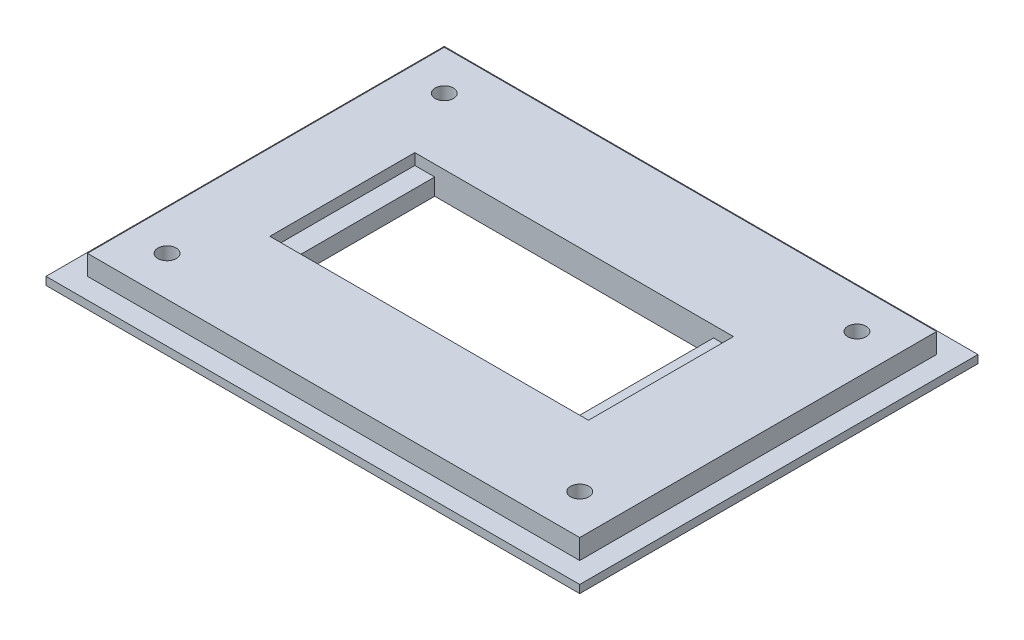
ISO-10303-21;
HEADER;
FILE_DESCRIPTION(('STEP AP214'),'2;1');
FILE_NAME('part.step','',(''),(''),'','','');
FILE_SCHEMA(('AUTOMOTIVE_DESIGN { 1 0 10303 214 1 1 1 1 }'));
ENDSEC;
DATA;
#1=APPLICATION_CONTEXT('core data for automotive mechanical design processes');
#2=APPLICATION_PROTOCOL_DEFINITION('international standard','automotive_design',2000,#1);
#3=PRODUCT_CONTEXT('',#1,'mechanical');
#4=PRODUCT('Part','Part','',(#3));
#5=PRODUCT_RELATED_PRODUCT_CATEGORY('part','',(#4));
#6=PRODUCT_DEFINITION_FORMATION('','',#4);
#7=PRODUCT_DEFINITION_CONTEXT('part definition',#1,'design');
#8=PRODUCT_DEFINITION('design','',#6,#7);
#9=PRODUCT_DEFINITION_SHAPE('','',#8);
#10=(LENGTH_UNIT() NAMED_UNIT(*) SI_UNIT(.MILLI.,.METRE.));
#11=(NAMED_UNIT(*) PLANE_ANGLE_UNIT() SI_UNIT($,.RADIAN.));
#12=(NAMED_UNIT(*) SI_UNIT($,.STERADIAN.) SOLID_ANGLE_UNIT());
#13=UNCERTAINTY_MEASURE_WITH_UNIT(LENGTH_MEASURE(1.E-05),#10,'distance_accuracy_value','');
#14=(GEOMETRIC_REPRESENTATION_CONTEXT(3) GLOBAL_UNCERTAINTY_ASSIGNED_CONTEXT((#13)) GLOBAL_UNIT_ASSIGNED_CONTEXT((#10,
#11,#12)) REPRESENTATION_CONTEXT('',''));
#15=CARTESIAN_POINT('',(0.,0.,0.));
#16=DIRECTION('',(0.,0.,1.));
#17=DIRECTION('',(1.,0.,0.));
#18=AXIS2_PLACEMENT_3D('',#15,#16,#17);
#19=CARTESIAN_POINT('',(0.,2.667,0.));
#20=DIRECTION('',(0.,1.,0.));
#21=DIRECTION('',(0.,0.,1.));
#22=AXIS2_PLACEMENT_3D('',#19,#20,#21);
#23=PLANE('',#22);
#24=DIRECTION('',(0.,0.,1.));
#25=VECTOR('',#24,1.);
#26=CARTESIAN_POINT('',(18.669,2.667,-43.307));
#27=LINE('',#26,#25);
#28=CARTESIAN_POINT('',(18.669,2.667,-43.307));
#29=VERTEX_POINT('',#28);
#30=CARTESIAN_POINT('',(18.669,2.667,-20.193));
#31=VERTEX_POINT('',#30);
#32=EDGE_CURVE('E154',#29,#31,#27,.T.);
#33=ORIENTED_EDGE('',*,*,#32,.F.);
#34=DIRECTION('',(-1.,0.,0.));
#35=VECTOR('',#34,1.);
#36=CARTESIAN_POINT('',(15.494,2.667,-43.307));
#37=LINE('',#36,#35);
#38=CARTESIAN_POINT('',(15.494,2.667,-43.307));
#39=VERTEX_POINT('',#38);
#40=EDGE_CURVE('E197',#29,#39,#37,.T.);
#41=ORIENTED_EDGE('',*,*,#40,.T.);
#42=DIRECTION('',(0.,0.,1.));
#43=VECTOR('',#42,1.);
#44=CARTESIAN_POINT('',(15.494,2.667,-43.307));
#45=LINE('',#44,#43);
#46=CARTESIAN_POINT('',(15.494,2.667,-20.193));
#47=VERTEX_POINT('',#46);
#48=EDGE_CURVE('E187',#39,#47,#45,.T.);
#49=ORIENTED_EDGE('',*,*,#48,.T.);
#50=DIRECTION('',(1.,0.,0.));
#51=VECTOR('',#50,1.);
#52=CARTESIAN_POINT('',(15.494,2.667,-20.193));
#53=LINE('',#52,#51);
#54=EDGE_CURVE('E192',#47,#31,#53,.T.);
#55=ORIENTED_EDGE('',*,*,#54,.T.);
#56=EDGE_LOOP('',(#33,#41,#49,#55));
#57=FACE_BOUND('',#56,.T.);
#58=ADVANCED_FACE('F35',(#57),#23,.T.);
#59=CARTESIAN_POINT('',(0.,1.27,0.));
#60=DIRECTION('',(0.,-1.,0.));
#61=DIRECTION('',(0.,0.,-1.));
#62=AXIS2_PLACEMENT_3D('',#59,#60,#61);
#63=PLANE('',#62);
#64=DIRECTION('',(0.,0.,1.));
#65=VECTOR('',#64,1.);
#66=CARTESIAN_POINT('',(0.,1.27,0.));
#67=LINE('',#66,#65);
#68=CARTESIAN_POINT('',(0.,1.27,-63.5));
#69=VERTEX_POINT('',#68);
#70=CARTESIAN_POINT('',(0.,1.27,0.));
#71=VERTEX_POINT('',#70);
#72=EDGE_CURVE('E252',#69,#71,#67,.T.);
#73=ORIENTED_EDGE('',*,*,#72,.T.);
#74=DIRECTION('',(1.,0.,0.));
#75=VECTOR('',#74,1.);
#76=CARTESIAN_POINT('',(0.,1.27,0.));
#77=LINE('',#76,#75);
#78=CARTESIAN_POINT('',(85.09,1.27,0.));
#79=VERTEX_POINT('',#78);
#80=EDGE_CURVE('E255',#71,#79,#77,.T.);
#81=ORIENTED_EDGE('',*,*,#80,.T.);
#82=DIRECTION('',(0.,0.,-1.));
#83=VECTOR('',#82,1.);
#84=CARTESIAN_POINT('',(85.09,1.27,0.));
#85=LINE('',#84,#83);
#86=CARTESIAN_POINT('',(85.09,1.27,-63.5));
#87=VERTEX_POINT('',#86);
#88=EDGE_CURVE('E258',#79,#87,#85,.T.);
#89=ORIENTED_EDGE('',*,*,#88,.T.);
#90=DIRECTION('',(-1.,0.,0.));
#91=VECTOR('',#90,1.);
#92=CARTESIAN_POINT('',(0.,1.27,-63.5));
#93=LINE('',#92,#91);
#94=EDGE_CURVE('E260',#87,#69,#93,.T.);
#95=ORIENTED_EDGE('',*,*,#94,.T.);
#96=EDGE_LOOP('',(#73,#81,#89,#95));
#97=FACE_BOUND('',#96,.T.);
#98=DIRECTION('',(0.,0.,1.));
#99=VECTOR('',#98,1.);
#100=CARTESIAN_POINT('',(3.302,1.27,-60.198));
#101=LINE('',#100,#99);
#102=CARTESIAN_POINT('',(3.302,1.27,-60.198));
#103=VERTEX_POINT('',#102);
#104=CARTESIAN_POINT('',(3.30200000000001,1.27,-3.302));
#105=VERTEX_POINT('',#104);
#106=EDGE_CURVE('E212',#103,#105,#101,.T.);
#107=ORIENTED_EDGE('',*,*,#106,.F.);
#108=DIRECTION('',(-1.,0.,0.));
#109=VECTOR('',#108,1.);
#110=CARTESIAN_POINT('',(3.302,1.27,-60.198));
#111=LINE('',#110,#109);
#112=CARTESIAN_POINT('',(81.788,1.27,-60.198));
#113=VERTEX_POINT('',#112);
#114=EDGE_CURVE('E223',#113,#103,#111,.T.);
#115=ORIENTED_EDGE('',*,*,#114,.F.);
#116=DIRECTION('',(0.,0.,-1.));
#117=VECTOR('',#116,1.);
#118=CARTESIAN_POINT('',(81.788,1.27,-60.198));
#119=LINE('',#118,#117);
#120=CARTESIAN_POINT('',(81.788,1.27,-3.302));
#121=VERTEX_POINT('',#120);
#122=EDGE_CURVE('E235',#121,#113,#119,.T.);
#123=ORIENTED_EDGE('',*,*,#122,.F.);
#124=DIRECTION('',(1.,0.,0.));
#125=VECTOR('',#124,1.);
#126=CARTESIAN_POINT('',(3.30200000000001,1.27,-3.302));
#127=LINE('',#126,#125);
#128=EDGE_CURVE('E232',#105,#121,#127,.T.);
#129=ORIENTED_EDGE('',*,*,#128,.F.);
#130=EDGE_LOOP('',(#107,#115,#123,#129));
#131=FACE_BOUND('',#130,.T.);
#132=ADVANCED_FACE('F292',(#97,#131),#63,.F.);
#133=CARTESIAN_POINT('',(0.,1.27,0.));
#134=DIRECTION('',(1.,0.,0.));
#135=DIRECTION('',(0.,0.,-1.));
#136=AXIS2_PLACEMENT_3D('',#133,#134,#135);
#137=PLANE('',#136);
#138=DIRECTION('',(0.,0.,1.));
#139=VECTOR('',#138,1.);
#140=CARTESIAN_POINT('',(0.,0.,0.));
#141=LINE('',#140,#139);
#142=CARTESIAN_POINT('',(0.,0.,-63.5));
#143=VERTEX_POINT('',#142);
#144=CARTESIAN_POINT('',(0.,0.,0.));
#145=VERTEX_POINT('',#144);
#146=EDGE_CURVE('E251',#143,#145,#141,.T.);
#147=ORIENTED_EDGE('',*,*,#146,.T.);
#148=DIRECTION('',(0.,-1.,0.));
#149=VECTOR('',#148,1.);
#150=CARTESIAN_POINT('',(0.,1.27,0.));
#151=LINE('',#150,#149);
#152=EDGE_CURVE('E11',#71,#145,#151,.T.);
#153=ORIENTED_EDGE('',*,*,#152,.F.);
#154=ORIENTED_EDGE('',*,*,#72,.F.);
#155=DIRECTION('',(0.,-1.,0.));
#156=VECTOR('',#155,1.);
#157=CARTESIAN_POINT('',(0.,1.27,-63.5));
#158=LINE('',#157,#156);
#159=EDGE_CURVE('E262',#69,#143,#158,.T.);
#160=ORIENTED_EDGE('',*,*,#159,.T.);
#161=EDGE_LOOP('',(#147,#153,#154,#160));
#162=FACE_BOUND('',#161,.T.);
#163=ADVANCED_FACE('F37',(#162),#137,.F.);
#164=CARTESIAN_POINT('',(0.,1.27,0.));
#165=DIRECTION('',(0.,0.,-1.));
#166=DIRECTION('',(-1.,0.,0.));
#167=AXIS2_PLACEMENT_3D('',#164,#165,#166);
#168=PLANE('',#167);
#169=DIRECTION('',(1.,0.,0.));
#170=VECTOR('',#169,1.);
#171=CARTESIAN_POINT('',(0.,0.,0.));
#172=LINE('',#171,#170);
#173=CARTESIAN_POINT('',(85.09,0.,0.));
#174=VERTEX_POINT('',#173);
#175=EDGE_CURVE('E265',#145,#174,#172,.T.);
#176=ORIENTED_EDGE('',*,*,#175,.T.);
#177=DIRECTION('',(0.,-1.,0.));
#178=VECTOR('',#177,1.);
#179=CARTESIAN_POINT('',(85.09,1.27,0.));
#180=LINE('',#179,#178);
#181=EDGE_CURVE('E43',#79,#174,#180,.T.);
#182=ORIENTED_EDGE('',*,*,#181,.F.);
#183=ORIENTED_EDGE('',*,*,#80,.F.);
#184=ORIENTED_EDGE('',*,*,#152,.T.);
#185=EDGE_LOOP('',(#176,#182,#183,#184));
#186=FACE_BOUND('',#185,.T.);
#187=ADVANCED_FACE('F294',(#186),#168,.F.);
#188=CARTESIAN_POINT('',(85.09,1.27,0.));
#189=DIRECTION('',(-1.,0.,0.));
#190=DIRECTION('',(0.,0.,1.));
#191=AXIS2_PLACEMENT_3D('',#188,#189,#190);
#192=PLANE('',#191);
#193=DIRECTION('',(0.,0.,-1.));
#194=VECTOR('',#193,1.);
#195=CARTESIAN_POINT('',(85.09,0.,0.));
#196=LINE('',#195,#194);
#197=CARTESIAN_POINT('',(85.09,0.,-63.5));
#198=VERTEX_POINT('',#197);
#199=EDGE_CURVE('E267',#174,#198,#196,.T.);
#200=ORIENTED_EDGE('',*,*,#199,.T.);
#201=DIRECTION('',(0.,-1.,0.));
#202=VECTOR('',#201,1.);
#203=CARTESIAN_POINT('',(85.09,1.27,-63.5));
#204=LINE('',#203,#202);
#205=EDGE_CURVE('E272',#87,#198,#204,.T.);
#206=ORIENTED_EDGE('',*,*,#205,.F.);
#207=ORIENTED_EDGE('',*,*,#88,.F.);
#208=ORIENTED_EDGE('',*,*,#181,.T.);
#209=EDGE_LOOP('',(#200,#206,#207,#208));
#210=FACE_BOUND('',#209,.T.);
#211=ADVANCED_FACE('F279',(#210),#192,.F.);
#212=CARTESIAN_POINT('',(0.,1.27,-63.5));
#213=DIRECTION('',(0.,0.,1.));
#214=DIRECTION('',(1.,0.,0.));
#215=AXIS2_PLACEMENT_3D('',#212,#213,#214);
#216=PLANE('',#215);
#217=DIRECTION('',(-1.,0.,0.));
#218=VECTOR('',#217,1.);
#219=CARTESIAN_POINT('',(0.,0.,-63.5));
#220=LINE('',#219,#218);
#221=EDGE_CURVE('E256',#198,#143,#220,.T.);
#222=ORIENTED_EDGE('',*,*,#221,.T.);
#223=ORIENTED_EDGE('',*,*,#159,.F.);
#224=ORIENTED_EDGE('',*,*,#94,.F.);
#225=ORIENTED_EDGE('',*,*,#205,.T.);
#226=EDGE_LOOP('',(#222,#223,#224,#225));
#227=FACE_BOUND('',#226,.T.);
#228=ADVANCED_FACE('F286',(#227),#216,.F.);
#229=CARTESIAN_POINT('',(0.,0.,0.));
#230=DIRECTION('',(0.,-1.,0.));
#231=DIRECTION('',(0.,0.,-1.));
#232=AXIS2_PLACEMENT_3D('',#229,#230,#231);
#233=PLANE('',#232);
#234=CARTESIAN_POINT('',(9.652,0.,-9.652));
#235=DIRECTION('',(0.,1.,0.));
#236=DIRECTION('',(0.,0.,1.));
#237=AXIS2_PLACEMENT_3D('',#234,#235,#236);
#238=CIRCLE('',#237,1.4605);
#239=CARTESIAN_POINT('',(9.652,0.,-8.1915));
#240=VERTEX_POINT('',#239);
#241=EDGE_CURVE('E362',#240,#240,#238,.T.);
#242=ORIENTED_EDGE('',*,*,#241,.T.);
#243=EDGE_LOOP('',(#242));
#244=FACE_BOUND('',#243,.T.);
#245=CARTESIAN_POINT('',(75.438,0.,-53.848));
#246=DIRECTION('',(0.,1.,0.));
#247=DIRECTION('',(0.,0.,1.));
#248=AXIS2_PLACEMENT_3D('',#245,#246,#247);
#249=CIRCLE('',#248,1.4605);
#250=CARTESIAN_POINT('',(75.438,0.,-52.3875));
#251=VERTEX_POINT('',#250);
#252=EDGE_CURVE('E368',#251,#251,#249,.T.);
#253=ORIENTED_EDGE('',*,*,#252,.T.);
#254=EDGE_LOOP('',(#253));
#255=FACE_BOUND('',#254,.T.);
#256=CARTESIAN_POINT('',(75.438,0.,-9.652));
#257=DIRECTION('',(0.,1.,0.));
#258=DIRECTION('',(0.,0.,1.));
#259=AXIS2_PLACEMENT_3D('',#256,#257,#258);
#260=CIRCLE('',#259,1.4605);
#261=CARTESIAN_POINT('',(75.438,0.,-8.1915));
#262=VERTEX_POINT('',#261);
#263=EDGE_CURVE('E353',#262,#262,#260,.T.);
#264=ORIENTED_EDGE('',*,*,#263,.T.);
#265=EDGE_LOOP('',(#264));
#266=FACE_BOUND('',#265,.T.);
#267=CARTESIAN_POINT('',(9.652,0.,-53.848));
#268=DIRECTION('',(0.,1.,0.));
#269=DIRECTION('',(0.,0.,1.));
#270=AXIS2_PLACEMENT_3D('',#267,#268,#269);
#271=CIRCLE('',#270,1.4605);
#272=CARTESIAN_POINT('',(9.652,0.,-52.3875));
#273=VERTEX_POINT('',#272);
#274=EDGE_CURVE('E179',#273,#273,#271,.T.);
#275=ORIENTED_EDGE('',*,*,#274,.T.);
#276=EDGE_LOOP('',(#275));
#277=FACE_BOUND('',#276,.T.);
#278=DIRECTION('',(0.,0.,1.));
#279=VECTOR('',#278,1.);
#280=CARTESIAN_POINT('',(18.669,0.,-43.307));
#281=LINE('',#280,#279);
#282=CARTESIAN_POINT('',(18.669,0.,-43.307));
#283=VERTEX_POINT('',#282);
#284=CARTESIAN_POINT('',(18.669,0.,-20.193));
#285=VERTEX_POINT('',#284);
#286=EDGE_CURVE('E151',#283,#285,#281,.T.);
#287=ORIENTED_EDGE('',*,*,#286,.T.);
#288=DIRECTION('',(1.,0.,0.));
#289=VECTOR('',#288,1.);
#290=CARTESIAN_POINT('',(18.669,0.,-20.193));
#291=LINE('',#290,#289);
#292=CARTESIAN_POINT('',(63.119,0.,-20.193));
#293=VERTEX_POINT('',#292);
#294=EDGE_CURVE('E161',#285,#293,#291,.T.);
#295=ORIENTED_EDGE('',*,*,#294,.T.);
#296=DIRECTION('',(0.,0.,-1.));
#297=VECTOR('',#296,1.);
#298=CARTESIAN_POINT('',(63.119,0.,-43.307));
#299=LINE('',#298,#297);
#300=CARTESIAN_POINT('',(63.119,0.,-43.307));
#301=VERTEX_POINT('',#300);
#302=EDGE_CURVE('E55',#293,#301,#299,.T.);
#303=ORIENTED_EDGE('',*,*,#302,.T.);
#304=DIRECTION('',(-1.,0.,0.));
#305=VECTOR('',#304,1.);
#306=CARTESIAN_POINT('',(18.669,0.,-43.307));
#307=LINE('',#306,#305);
#308=EDGE_CURVE('E158',#301,#283,#307,.T.);
#309=ORIENTED_EDGE('',*,*,#308,.T.);
#310=EDGE_LOOP('',(#287,#295,#303,#309));
#311=FACE_BOUND('',#310,.T.);
#312=ORIENTED_EDGE('',*,*,#146,.F.);
#313=ORIENTED_EDGE('',*,*,#221,.F.);
#314=ORIENTED_EDGE('',*,*,#199,.F.);
#315=ORIENTED_EDGE('',*,*,#175,.F.);
#316=EDGE_LOOP('',(#312,#313,#314,#315));
#317=FACE_BOUND('',#316,.T.);
#318=ADVANCED_FACE('F167',(#244,#255,#266,#277,#311,#317),#233,.T.);
#319=CARTESIAN_POINT('',(3.302,4.445,-60.198));
#320=DIRECTION('',(1.,0.,0.));
#321=DIRECTION('',(0.,0.,-1.));
#322=AXIS2_PLACEMENT_3D('',#319,#320,#321);
#323=PLANE('',#322);
#324=ORIENTED_EDGE('',*,*,#106,.T.);
#325=DIRECTION('',(0.,-1.,0.));
#326=VECTOR('',#325,1.);
#327=CARTESIAN_POINT('',(3.30200000000001,4.445,-3.302));
#328=LINE('',#327,#326);
#329=CARTESIAN_POINT('',(3.30200000000001,4.445,-3.302));
#330=VERTEX_POINT('',#329);
#331=EDGE_CURVE('E248',#330,#105,#328,.T.);
#332=ORIENTED_EDGE('',*,*,#331,.F.);
#333=DIRECTION('',(0.,0.,1.));
#334=VECTOR('',#333,1.);
#335=CARTESIAN_POINT('',(3.302,4.445,-60.198));
#336=LINE('',#335,#334);
#337=CARTESIAN_POINT('',(3.302,4.445,-60.198));
#338=VERTEX_POINT('',#337);
#339=EDGE_CURVE('E219',#338,#330,#336,.T.);
#340=ORIENTED_EDGE('',*,*,#339,.F.);
#341=DIRECTION('',(0.,-1.,0.));
#342=VECTOR('',#341,1.);
#343=CARTESIAN_POINT('',(3.302,4.445,-60.198));
#344=LINE('',#343,#342);
#345=EDGE_CURVE('E229',#338,#103,#344,.T.);
#346=ORIENTED_EDGE('',*,*,#345,.T.);
#347=EDGE_LOOP('',(#324,#332,#340,#346));
#348=FACE_BOUND('',#347,.T.);
#349=ADVANCED_FACE('F395',(#348),#323,.F.);
#350=CARTESIAN_POINT('',(3.30200000000001,4.445,-3.302));
#351=DIRECTION('',(0.,0.,-1.));
#352=DIRECTION('',(-1.,0.,0.));
#353=AXIS2_PLACEMENT_3D('',#350,#351,#352);
#354=PLANE('',#353);
#355=ORIENTED_EDGE('',*,*,#128,.T.);
#356=DIRECTION('',(0.,-1.,0.));
#357=VECTOR('',#356,1.);
#358=CARTESIAN_POINT('',(81.788,4.445,-3.302));
#359=LINE('',#358,#357);
#360=CARTESIAN_POINT('',(81.788,4.445,-3.302));
#361=VERTEX_POINT('',#360);
#362=EDGE_CURVE('E245',#361,#121,#359,.T.);
#363=ORIENTED_EDGE('',*,*,#362,.F.);
#364=DIRECTION('',(1.,0.,0.));
#365=VECTOR('',#364,1.);
#366=CARTESIAN_POINT('',(3.30200000000001,4.445,-3.302));
#367=LINE('',#366,#365);
#368=EDGE_CURVE('E222',#330,#361,#367,.T.);
#369=ORIENTED_EDGE('',*,*,#368,.F.);
#370=ORIENTED_EDGE('',*,*,#331,.T.);
#371=EDGE_LOOP('',(#355,#363,#369,#370));
#372=FACE_BOUND('',#371,.T.);
#373=ADVANCED_FACE('F397',(#372),#354,.F.);
#374=CARTESIAN_POINT('',(81.788,4.445,-60.198));
#375=DIRECTION('',(-1.,0.,0.));
#376=DIRECTION('',(0.,0.,1.));
#377=AXIS2_PLACEMENT_3D('',#374,#375,#376);
#378=PLANE('',#377);
#379=ORIENTED_EDGE('',*,*,#122,.T.);
#380=DIRECTION('',(0.,-1.,0.));
#381=VECTOR('',#380,1.);
#382=CARTESIAN_POINT('',(81.788,4.445,-60.198));
#383=LINE('',#382,#381);
#384=CARTESIAN_POINT('',(81.788,4.445,-60.198));
#385=VERTEX_POINT('',#384);
#386=EDGE_CURVE('E242',#385,#113,#383,.T.);
#387=ORIENTED_EDGE('',*,*,#386,.F.);
#388=DIRECTION('',(0.,0.,-1.));
#389=VECTOR('',#388,1.);
#390=CARTESIAN_POINT('',(81.788,4.445,-60.198));
#391=LINE('',#390,#389);
#392=EDGE_CURVE('E225',#361,#385,#391,.T.);
#393=ORIENTED_EDGE('',*,*,#392,.F.);
#394=ORIENTED_EDGE('',*,*,#362,.T.);
#395=EDGE_LOOP('',(#379,#387,#393,#394));
#396=FACE_BOUND('',#395,.T.);
#397=ADVANCED_FACE('F401',(#396),#378,.F.);
#398=CARTESIAN_POINT('',(3.302,4.445,-60.198));
#399=DIRECTION('',(0.,0.,1.));
#400=DIRECTION('',(1.,0.,0.));
#401=AXIS2_PLACEMENT_3D('',#398,#399,#400);
#402=PLANE('',#401);
#403=ORIENTED_EDGE('',*,*,#114,.T.);
#404=ORIENTED_EDGE('',*,*,#345,.F.);
#405=DIRECTION('',(-1.,0.,0.));
#406=VECTOR('',#405,1.);
#407=CARTESIAN_POINT('',(3.302,4.445,-60.198));
#408=LINE('',#407,#406);
#409=EDGE_CURVE('E227',#385,#338,#408,.T.);
#410=ORIENTED_EDGE('',*,*,#409,.F.);
#411=ORIENTED_EDGE('',*,*,#386,.T.);
#412=EDGE_LOOP('',(#403,#404,#410,#411));
#413=FACE_BOUND('',#412,.T.);
#414=ADVANCED_FACE('F383',(#413),#402,.F.);
#415=CARTESIAN_POINT('',(0.,4.445,0.));
#416=DIRECTION('',(0.,1.,0.));
#417=DIRECTION('',(0.,0.,1.));
#418=AXIS2_PLACEMENT_3D('',#415,#416,#417);
#419=PLANE('',#418);
#420=CARTESIAN_POINT('',(9.652,4.445,-9.652));
#421=DIRECTION('',(0.,1.,0.));
#422=DIRECTION('',(0.,0.,1.));
#423=AXIS2_PLACEMENT_3D('',#420,#421,#422);
#424=CIRCLE('',#423,1.4605);
#425=CARTESIAN_POINT('',(9.652,4.445,-8.1915));
#426=VERTEX_POINT('',#425);
#427=EDGE_CURVE('E365',#426,#426,#424,.T.);
#428=ORIENTED_EDGE('',*,*,#427,.F.);
#429=EDGE_LOOP('',(#428));
#430=FACE_BOUND('',#429,.T.);
#431=CARTESIAN_POINT('',(75.438,4.445,-53.848));
#432=DIRECTION('',(0.,1.,0.));
#433=DIRECTION('',(0.,0.,1.));
#434=AXIS2_PLACEMENT_3D('',#431,#432,#433);
#435=CIRCLE('',#434,1.4605);
#436=CARTESIAN_POINT('',(75.438,4.445,-52.3875));
#437=VERTEX_POINT('',#436);
#438=EDGE_CURVE('E359',#437,#437,#435,.T.);
#439=ORIENTED_EDGE('',*,*,#438,.F.);
#440=EDGE_LOOP('',(#439));
#441=FACE_BOUND('',#440,.T.);
#442=CARTESIAN_POINT('',(75.438,4.445,-9.652));
#443=DIRECTION('',(0.,1.,0.));
#444=DIRECTION('',(0.,0.,1.));
#445=AXIS2_PLACEMENT_3D('',#442,#443,#444);
#446=CIRCLE('',#445,1.4605);
#447=CARTESIAN_POINT('',(75.438,4.445,-8.1915));
#448=VERTEX_POINT('',#447);
#449=EDGE_CURVE('E356',#448,#448,#446,.T.);
#450=ORIENTED_EDGE('',*,*,#449,.F.);
#451=EDGE_LOOP('',(#450));
#452=FACE_BOUND('',#451,.T.);
#453=CARTESIAN_POINT('',(9.652,4.445,-53.848));
#454=DIRECTION('',(0.,1.,0.));
#455=DIRECTION('',(0.,0.,1.));
#456=AXIS2_PLACEMENT_3D('',#453,#454,#455);
#457=CIRCLE('',#456,1.4605);
#458=CARTESIAN_POINT('',(9.652,4.445,-52.3875));
#459=VERTEX_POINT('',#458);
#460=EDGE_CURVE('E174',#459,#459,#457,.T.);
#461=ORIENTED_EDGE('',*,*,#460,.F.);
#462=EDGE_LOOP('',(#461));
#463=FACE_BOUND('',#462,.T.);
#464=DIRECTION('',(0.,0.,1.));
#465=VECTOR('',#464,1.);
#466=CARTESIAN_POINT('',(15.494,4.445,-43.307));
#467=LINE('',#466,#465);
#468=CARTESIAN_POINT('',(15.494,4.445,-43.307));
#469=VERTEX_POINT('',#468);
#470=CARTESIAN_POINT('',(15.494,4.445,-20.193));
#471=VERTEX_POINT('',#470);
#472=EDGE_CURVE('E183',#469,#471,#467,.T.);
#473=ORIENTED_EDGE('',*,*,#472,.F.);
#474=DIRECTION('',(-1.,0.,0.));
#475=VECTOR('',#474,1.);
#476=CARTESIAN_POINT('',(15.494,4.445,-43.307));
#477=LINE('',#476,#475);
#478=CARTESIAN_POINT('',(66.294,4.445,-43.307));
#479=VERTEX_POINT('',#478);
#480=EDGE_CURVE('E191',#479,#469,#477,.T.);
#481=ORIENTED_EDGE('',*,*,#480,.F.);
#482=DIRECTION('',(0.,0.,-1.));
#483=VECTOR('',#482,1.);
#484=CARTESIAN_POINT('',(66.294,4.445,-43.307));
#485=LINE('',#484,#483);
#486=CARTESIAN_POINT('',(66.294,4.445,-20.193));
#487=VERTEX_POINT('',#486);
#488=EDGE_CURVE('E205',#487,#479,#485,.T.);
#489=ORIENTED_EDGE('',*,*,#488,.F.);
#490=DIRECTION('',(1.,0.,0.));
#491=VECTOR('',#490,1.);
#492=CARTESIAN_POINT('',(15.494,4.445,-20.193));
#493=LINE('',#492,#491);
#494=EDGE_CURVE('E203',#471,#487,#493,.T.);
#495=ORIENTED_EDGE('',*,*,#494,.F.);
#496=EDGE_LOOP('',(#473,#481,#489,#495));
#497=FACE_BOUND('',#496,.T.);
#498=ORIENTED_EDGE('',*,*,#339,.T.);
#499=ORIENTED_EDGE('',*,*,#368,.T.);
#500=ORIENTED_EDGE('',*,*,#392,.T.);
#501=ORIENTED_EDGE('',*,*,#409,.T.);
#502=EDGE_LOOP('',(#498,#499,#500,#501));
#503=FACE_BOUND('',#502,.T.);
#504=ADVANCED_FACE('F379',(#430,#441,#452,#463,#497,#503),#419,.T.);
#505=CARTESIAN_POINT('',(15.494,2.667,-43.307));
#506=DIRECTION('',(-1.,0.,0.));
#507=DIRECTION('',(0.,0.,1.));
#508=AXIS2_PLACEMENT_3D('',#505,#506,#507);
#509=PLANE('',#508);
#510=ORIENTED_EDGE('',*,*,#472,.T.);
#511=DIRECTION('',(0.,1.,0.));
#512=VECTOR('',#511,1.);
#513=CARTESIAN_POINT('',(15.494,2.667,-20.193));
#514=LINE('',#513,#512);
#515=EDGE_CURVE('E201',#47,#471,#514,.T.);
#516=ORIENTED_EDGE('',*,*,#515,.F.);
#517=ORIENTED_EDGE('',*,*,#48,.F.);
#518=DIRECTION('',(0.,1.,0.));
#519=VECTOR('',#518,1.);
#520=CARTESIAN_POINT('',(15.494,2.667,-43.307));
#521=LINE('',#520,#519);
#522=EDGE_CURVE('E210',#39,#469,#521,.T.);
#523=ORIENTED_EDGE('',*,*,#522,.T.);
#524=EDGE_LOOP('',(#510,#516,#517,#523));
#525=FACE_BOUND('',#524,.T.);
#526=ADVANCED_FACE('F382',(#525),#509,.F.);
#527=CARTESIAN_POINT('',(15.494,2.667,-43.307));
#528=DIRECTION('',(0.,0.,-1.));
#529=DIRECTION('',(-1.,0.,0.));
#530=AXIS2_PLACEMENT_3D('',#527,#528,#529);
#531=PLANE('',#530);
#532=ORIENTED_EDGE('',*,*,#480,.T.);
#533=ORIENTED_EDGE('',*,*,#522,.F.);
#534=ORIENTED_EDGE('',*,*,#40,.F.);
#535=DIRECTION('',(0.,1.,0.));
#536=VECTOR('',#535,1.);
#537=CARTESIAN_POINT('',(18.669,0.,-43.307));
#538=LINE('',#537,#536);
#539=EDGE_CURVE('E181',#283,#29,#538,.T.);
#540=ORIENTED_EDGE('',*,*,#539,.F.);
#541=ORIENTED_EDGE('',*,*,#308,.F.);
#542=DIRECTION('',(0.,1.,0.));
#543=VECTOR('',#542,1.);
#544=CARTESIAN_POINT('',(63.119,0.,-43.307));
#545=LINE('',#544,#543);
#546=CARTESIAN_POINT('',(63.119,2.667,-43.307));
#547=VERTEX_POINT('',#546);
#548=EDGE_CURVE('E184',#301,#547,#545,.T.);
#549=ORIENTED_EDGE('',*,*,#548,.T.);
#550=CARTESIAN_POINT('',(66.294,2.667,-43.307));
#551=VERTEX_POINT('',#550);
#552=EDGE_CURVE('E198',#551,#547,#37,.T.);
#553=ORIENTED_EDGE('',*,*,#552,.F.);
#554=DIRECTION('',(0.,1.,0.));
#555=VECTOR('',#554,1.);
#556=CARTESIAN_POINT('',(66.294,2.667,-43.307));
#557=LINE('',#556,#555);
#558=EDGE_CURVE('E213',#551,#479,#557,.T.);
#559=ORIENTED_EDGE('',*,*,#558,.T.);
#560=EDGE_LOOP('',(#532,#533,#534,#540,#541,#549,#553,#559));
#561=FACE_BOUND('',#560,.T.);
#562=ADVANCED_FACE('F327',(#561),#531,.F.);
#563=CARTESIAN_POINT('',(66.294,2.667,-43.307));
#564=DIRECTION('',(1.,0.,0.));
#565=DIRECTION('',(0.,0.,-1.));
#566=AXIS2_PLACEMENT_3D('',#563,#564,#565);
#567=PLANE('',#566);
#568=ORIENTED_EDGE('',*,*,#488,.T.);
#569=ORIENTED_EDGE('',*,*,#558,.F.);
#570=DIRECTION('',(0.,0.,-1.));
#571=VECTOR('',#570,1.);
#572=CARTESIAN_POINT('',(66.294,2.667,-43.307));
#573=LINE('',#572,#571);
#574=CARTESIAN_POINT('',(66.294,2.667,-20.193));
#575=VERTEX_POINT('',#574);
#576=EDGE_CURVE('E194',#575,#551,#573,.T.);
#577=ORIENTED_EDGE('',*,*,#576,.F.);
#578=DIRECTION('',(0.,1.,0.));
#579=VECTOR('',#578,1.);
#580=CARTESIAN_POINT('',(66.294,2.667,-20.193));
#581=LINE('',#580,#579);
#582=EDGE_CURVE('E215',#575,#487,#581,.T.);
#583=ORIENTED_EDGE('',*,*,#582,.T.);
#584=EDGE_LOOP('',(#568,#569,#577,#583));
#585=FACE_BOUND('',#584,.T.);
#586=ADVANCED_FACE('F318',(#585),#567,.F.);
#587=CARTESIAN_POINT('',(15.494,2.667,-20.193));
#588=DIRECTION('',(0.,0.,1.));
#589=DIRECTION('',(1.,0.,0.));
#590=AXIS2_PLACEMENT_3D('',#587,#588,#589);
#591=PLANE('',#590);
#592=ORIENTED_EDGE('',*,*,#494,.T.);
#593=ORIENTED_EDGE('',*,*,#582,.F.);
#594=CARTESIAN_POINT('',(63.119,2.667,-20.193));
#595=VERTEX_POINT('',#594);
#596=EDGE_CURVE('E190',#595,#575,#53,.T.);
#597=ORIENTED_EDGE('',*,*,#596,.F.);
#598=DIRECTION('',(0.,1.,0.));
#599=VECTOR('',#598,1.);
#600=CARTESIAN_POINT('',(63.119,0.,-20.193));
#601=LINE('',#600,#599);
#602=EDGE_CURVE('E50',#293,#595,#601,.T.);
#603=ORIENTED_EDGE('',*,*,#602,.F.);
#604=ORIENTED_EDGE('',*,*,#294,.F.);
#605=DIRECTION('',(0.,1.,0.));
#606=VECTOR('',#605,1.);
#607=CARTESIAN_POINT('',(18.669,0.,-20.193));
#608=LINE('',#607,#606);
#609=EDGE_CURVE('E147',#285,#31,#608,.T.);
#610=ORIENTED_EDGE('',*,*,#609,.T.);
#611=ORIENTED_EDGE('',*,*,#54,.F.);
#612=ORIENTED_EDGE('',*,*,#515,.T.);
#613=EDGE_LOOP('',(#592,#593,#597,#603,#604,#610,#611,#612));
#614=FACE_BOUND('',#613,.T.);
#615=ADVANCED_FACE('F163',(#614),#591,.F.);
#616=DIRECTION('',(0.,0.,-1.));
#617=VECTOR('',#616,1.);
#618=CARTESIAN_POINT('',(63.119,2.667,-43.307));
#619=LINE('',#618,#617);
#620=EDGE_CURVE('E170',#595,#547,#619,.T.);
#621=ORIENTED_EDGE('',*,*,#620,.F.);
#622=ORIENTED_EDGE('',*,*,#596,.T.);
#623=ORIENTED_EDGE('',*,*,#576,.T.);
#624=ORIENTED_EDGE('',*,*,#552,.T.);
#625=EDGE_LOOP('',(#621,#622,#623,#624));
#626=FACE_BOUND('',#625,.T.);
#627=ADVANCED_FACE('F304',(#626),#23,.T.);
#628=CARTESIAN_POINT('',(18.669,0.,-43.307));
#629=DIRECTION('',(-1.,0.,0.));
#630=DIRECTION('',(0.,0.,1.));
#631=AXIS2_PLACEMENT_3D('',#628,#629,#630);
#632=PLANE('',#631);
#633=ORIENTED_EDGE('',*,*,#32,.T.);
#634=ORIENTED_EDGE('',*,*,#609,.F.);
#635=ORIENTED_EDGE('',*,*,#286,.F.);
#636=ORIENTED_EDGE('',*,*,#539,.T.);
#637=EDGE_LOOP('',(#633,#634,#635,#636));
#638=FACE_BOUND('',#637,.T.);
#639=ADVANCED_FACE('F149',(#638),#632,.F.);
#640=CARTESIAN_POINT('',(63.119,0.,-43.307));
#641=DIRECTION('',(1.,0.,0.));
#642=DIRECTION('',(0.,0.,-1.));
#643=AXIS2_PLACEMENT_3D('',#640,#641,#642);
#644=PLANE('',#643);
#645=ORIENTED_EDGE('',*,*,#620,.T.);
#646=ORIENTED_EDGE('',*,*,#548,.F.);
#647=ORIENTED_EDGE('',*,*,#302,.F.);
#648=ORIENTED_EDGE('',*,*,#602,.T.);
#649=EDGE_LOOP('',(#645,#646,#647,#648));
#650=FACE_BOUND('',#649,.T.);
#651=ADVANCED_FACE('F317',(#650),#644,.F.);
#652=CARTESIAN_POINT('',(9.652,0.,-53.848));
#653=DIRECTION('',(0.,1.,0.));
#654=DIRECTION('',(0.,0.,1.));
#655=AXIS2_PLACEMENT_3D('',#652,#653,#654);
#656=CYLINDRICAL_SURFACE('',#655,1.4605);
#657=ORIENTED_EDGE('',*,*,#274,.F.);
#658=EDGE_LOOP('',(#657));
#659=FACE_BOUND('',#658,.T.);
#660=ORIENTED_EDGE('',*,*,#460,.T.);
#661=EDGE_LOOP('',(#660));
#662=FACE_BOUND('',#661,.T.);
#663=ADVANCED_FACE('F329',(#659,#662),#656,.F.);
#664=CARTESIAN_POINT('',(75.438,0.,-9.652));
#665=DIRECTION('',(0.,1.,0.));
#666=DIRECTION('',(0.,0.,1.));
#667=AXIS2_PLACEMENT_3D('',#664,#665,#666);
#668=CYLINDRICAL_SURFACE('',#667,1.4605);
#669=ORIENTED_EDGE('',*,*,#263,.F.);
#670=EDGE_LOOP('',(#669));
#671=FACE_BOUND('',#670,.T.);
#672=ORIENTED_EDGE('',*,*,#449,.T.);
#673=EDGE_LOOP('',(#672));
#674=FACE_BOUND('',#673,.T.);
#675=ADVANCED_FACE('F334',(#671,#674),#668,.F.);
#676=CARTESIAN_POINT('',(75.438,0.,-53.848));
#677=DIRECTION('',(0.,1.,0.));
#678=DIRECTION('',(0.,0.,1.));
#679=AXIS2_PLACEMENT_3D('',#676,#677,#678);
#680=CYLINDRICAL_SURFACE('',#679,1.4605);
#681=ORIENTED_EDGE('',*,*,#252,.F.);
#682=EDGE_LOOP('',(#681));
#683=FACE_BOUND('',#682,.T.);
#684=ORIENTED_EDGE('',*,*,#438,.T.);
#685=EDGE_LOOP('',(#684));
#686=FACE_BOUND('',#685,.T.);
#687=ADVANCED_FACE('F338',(#683,#686),#680,.F.);
#688=CARTESIAN_POINT('',(9.652,0.,-9.652));
#689=DIRECTION('',(0.,1.,0.));
#690=DIRECTION('',(0.,0.,1.));
#691=AXIS2_PLACEMENT_3D('',#688,#689,#690);
#692=CYLINDRICAL_SURFACE('',#691,1.4605);
#693=ORIENTED_EDGE('',*,*,#241,.F.);
#694=EDGE_LOOP('',(#693));
#695=FACE_BOUND('',#694,.T.);
#696=ORIENTED_EDGE('',*,*,#427,.T.);
#697=EDGE_LOOP('',(#696));
#698=FACE_BOUND('',#697,.T.);
#699=ADVANCED_FACE('F341',(#695,#698),#692,.F.);
#700=CLOSED_SHELL('',(#58,#132,#163,#187,#211,#228,#318,#349,#373,#397,#414,#504,#526,#562,#586,
#615,#627,#639,#651,#663,#675,#687,#699));
#701=MANIFOLD_SOLID_BREP('B2',#700);
#702=ADVANCED_BREP_SHAPE_REPRESENTATION('',(#18,#701),#14);
#703=SHAPE_DEFINITION_REPRESENTATION(#9,#702);
ENDSEC;
END-ISO-10303-21;
